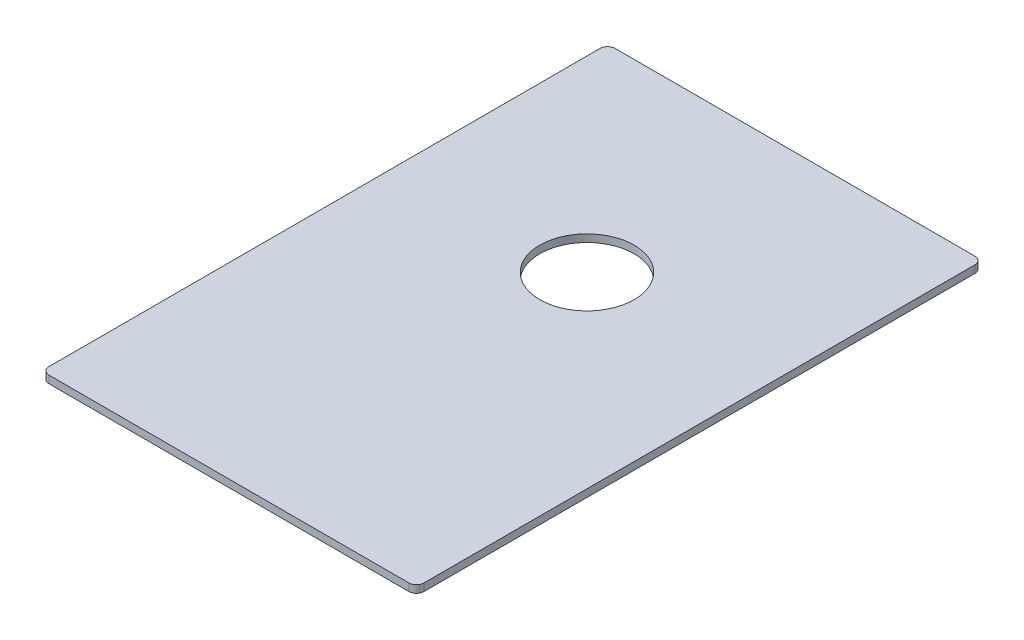
ISO-10303-21;
HEADER;
FILE_DESCRIPTION(('STEP AP214'),'2;1');
FILE_NAME('part.step','',(''),(''),'','','');
FILE_SCHEMA(('AUTOMOTIVE_DESIGN { 1 0 10303 214 1 1 1 1 }'));
ENDSEC;
DATA;
#1=APPLICATION_CONTEXT('core data for automotive mechanical design processes');
#2=APPLICATION_PROTOCOL_DEFINITION('international standard','automotive_design',2000,#1);
#3=PRODUCT_CONTEXT('',#1,'mechanical');
#4=PRODUCT('Part','Part','',(#3));
#5=PRODUCT_RELATED_PRODUCT_CATEGORY('part','',(#4));
#6=PRODUCT_DEFINITION_FORMATION('','',#4);
#7=PRODUCT_DEFINITION_CONTEXT('part definition',#1,'design');
#8=PRODUCT_DEFINITION('design','',#6,#7);
#9=PRODUCT_DEFINITION_SHAPE('','',#8);
#10=(LENGTH_UNIT() NAMED_UNIT(*) SI_UNIT(.MILLI.,.METRE.));
#11=(NAMED_UNIT(*) PLANE_ANGLE_UNIT() SI_UNIT($,.RADIAN.));
#12=(NAMED_UNIT(*) SI_UNIT($,.STERADIAN.) SOLID_ANGLE_UNIT());
#13=UNCERTAINTY_MEASURE_WITH_UNIT(LENGTH_MEASURE(1.E-05),#10,'distance_accuracy_value','');
#14=(GEOMETRIC_REPRESENTATION_CONTEXT(3) GLOBAL_UNCERTAINTY_ASSIGNED_CONTEXT((#13)) GLOBAL_UNIT_ASSIGNED_CONTEXT((#10,
#11,#12)) REPRESENTATION_CONTEXT('',''));
#15=CARTESIAN_POINT('',(0.,0.,0.));
#16=DIRECTION('',(0.,0.,1.));
#17=DIRECTION('',(1.,0.,0.));
#18=AXIS2_PLACEMENT_3D('',#15,#16,#17);
#19=CARTESIAN_POINT('',(-250.,10.,377.5));
#20=DIRECTION('',(0.,0.,-1.));
#21=DIRECTION('',(-1.,0.,0.));
#22=AXIS2_PLACEMENT_3D('',#19,#20,#21);
#23=PLANE('',#22);
#24=DIRECTION('',(1.,0.,0.));
#25=VECTOR('',#24,1.);
#26=CARTESIAN_POINT('',(-250.,10.,377.5));
#27=LINE('',#26,#25);
#28=CARTESIAN_POINT('',(-240.,10.,377.5));
#29=VERTEX_POINT('',#28);
#30=CARTESIAN_POINT('',(240.,10.,377.5));
#31=VERTEX_POINT('',#30);
#32=EDGE_CURVE('E118',#29,#31,#27,.T.);
#33=ORIENTED_EDGE('',*,*,#32,.F.);
#34=DIRECTION('',(0.,-1.,0.));
#35=VECTOR('',#34,1.);
#36=CARTESIAN_POINT('',(-240.,0.,377.5));
#37=LINE('',#36,#35);
#38=CARTESIAN_POINT('',(-240.,0.,377.5));
#39=VERTEX_POINT('',#38);
#40=EDGE_CURVE('E103',#29,#39,#37,.T.);
#41=ORIENTED_EDGE('',*,*,#40,.T.);
#42=DIRECTION('',(1.,0.,0.));
#43=VECTOR('',#42,1.);
#44=CARTESIAN_POINT('',(-250.,0.,377.5));
#45=LINE('',#44,#43);
#46=CARTESIAN_POINT('',(240.,0.,377.5));
#47=VERTEX_POINT('',#46);
#48=EDGE_CURVE('E115',#39,#47,#45,.T.);
#49=ORIENTED_EDGE('',*,*,#48,.T.);
#50=DIRECTION('',(0.,-1.,0.));
#51=VECTOR('',#50,1.);
#52=CARTESIAN_POINT('',(240.,10.,377.5));
#53=LINE('',#52,#51);
#54=EDGE_CURVE('E120',#47,#31,#53,.F.);
#55=ORIENTED_EDGE('',*,*,#54,.T.);
#56=EDGE_LOOP('',(#33,#41,#49,#55));
#57=FACE_BOUND('',#56,.T.);
#58=ADVANCED_FACE('F33',(#57),#23,.F.);
#59=CARTESIAN_POINT('',(250.,10.,377.5));
#60=DIRECTION('',(-1.,0.,0.));
#61=DIRECTION('',(0.,0.,1.));
#62=AXIS2_PLACEMENT_3D('',#59,#60,#61);
#63=PLANE('',#62);
#64=DIRECTION('',(0.,0.,-1.));
#65=VECTOR('',#64,1.);
#66=CARTESIAN_POINT('',(250.,10.,377.5));
#67=LINE('',#66,#65);
#68=CARTESIAN_POINT('',(250.,10.,367.5));
#69=VERTEX_POINT('',#68);
#70=CARTESIAN_POINT('',(250.,10.,-367.5));
#71=VERTEX_POINT('',#70);
#72=EDGE_CURVE('E165',#69,#71,#67,.T.);
#73=ORIENTED_EDGE('',*,*,#72,.F.);
#74=DIRECTION('',(0.,-1.,0.));
#75=VECTOR('',#74,1.);
#76=CARTESIAN_POINT('',(250.,10.,367.5));
#77=LINE('',#76,#75);
#78=CARTESIAN_POINT('',(250.,0.,367.5));
#79=VERTEX_POINT('',#78);
#80=EDGE_CURVE('E158',#69,#79,#77,.T.);
#81=ORIENTED_EDGE('',*,*,#80,.T.);
#82=DIRECTION('',(0.,0.,-1.));
#83=VECTOR('',#82,1.);
#84=CARTESIAN_POINT('',(250.,0.,377.5));
#85=LINE('',#84,#83);
#86=CARTESIAN_POINT('',(250.,0.,-367.5));
#87=VERTEX_POINT('',#86);
#88=EDGE_CURVE('E124',#79,#87,#85,.T.);
#89=ORIENTED_EDGE('',*,*,#88,.T.);
#90=DIRECTION('',(0.,-1.,0.));
#91=VECTOR('',#90,1.);
#92=CARTESIAN_POINT('',(250.,10.,-367.5));
#93=LINE('',#92,#91);
#94=EDGE_CURVE('E156',#87,#71,#93,.F.);
#95=ORIENTED_EDGE('',*,*,#94,.T.);
#96=EDGE_LOOP('',(#73,#81,#89,#95));
#97=FACE_BOUND('',#96,.T.);
#98=ADVANCED_FACE('F163',(#97),#63,.F.);
#99=CARTESIAN_POINT('',(-250.,10.,-377.5));
#100=DIRECTION('',(0.,0.,-1.));
#101=DIRECTION('',(-1.,0.,0.));
#102=AXIS2_PLACEMENT_3D('',#99,#100,#101);
#103=PLANE('',#102);
#104=DIRECTION('',(1.,0.,0.));
#105=VECTOR('',#104,1.);
#106=CARTESIAN_POINT('',(-250.,10.,-377.5));
#107=LINE('',#106,#105);
#108=CARTESIAN_POINT('',(-240.,10.,-377.5));
#109=VERTEX_POINT('',#108);
#110=CARTESIAN_POINT('',(240.,10.,-377.5));
#111=VERTEX_POINT('',#110);
#112=EDGE_CURVE('E172',#109,#111,#107,.T.);
#113=ORIENTED_EDGE('',*,*,#112,.T.);
#114=DIRECTION('',(0.,-1.,0.));
#115=VECTOR('',#114,1.);
#116=CARTESIAN_POINT('',(240.,0.,-377.5));
#117=LINE('',#116,#115);
#118=CARTESIAN_POINT('',(240.,0.,-377.5));
#119=VERTEX_POINT('',#118);
#120=EDGE_CURVE('E11',#111,#119,#117,.T.);
#121=ORIENTED_EDGE('',*,*,#120,.T.);
#122=DIRECTION('',(1.,0.,0.));
#123=VECTOR('',#122,1.);
#124=CARTESIAN_POINT('',(-250.,0.,-377.5));
#125=LINE('',#124,#123);
#126=CARTESIAN_POINT('',(-240.,0.,-377.5));
#127=VERTEX_POINT('',#126);
#128=EDGE_CURVE('E128',#127,#119,#125,.T.);
#129=ORIENTED_EDGE('',*,*,#128,.F.);
#130=DIRECTION('',(0.,-1.,0.));
#131=VECTOR('',#130,1.);
#132=CARTESIAN_POINT('',(-240.,10.,-377.5));
#133=LINE('',#132,#131);
#134=EDGE_CURVE('E41',#127,#109,#133,.F.);
#135=ORIENTED_EDGE('',*,*,#134,.T.);
#136=EDGE_LOOP('',(#113,#121,#129,#135));
#137=FACE_BOUND('',#136,.T.);
#138=ADVANCED_FACE('F171',(#137),#103,.T.);
#139=CARTESIAN_POINT('',(-250.,10.,377.5));
#140=DIRECTION('',(-1.,0.,0.));
#141=DIRECTION('',(0.,0.,1.));
#142=AXIS2_PLACEMENT_3D('',#139,#140,#141);
#143=PLANE('',#142);
#144=DIRECTION('',(0.,0.,-1.));
#145=VECTOR('',#144,1.);
#146=CARTESIAN_POINT('',(-250.,0.,377.5));
#147=LINE('',#146,#145);
#148=CARTESIAN_POINT('',(-250.,0.,367.5));
#149=VERTEX_POINT('',#148);
#150=CARTESIAN_POINT('',(-250.,0.,-367.5));
#151=VERTEX_POINT('',#150);
#152=EDGE_CURVE('E139',#149,#151,#147,.T.);
#153=ORIENTED_EDGE('',*,*,#152,.F.);
#154=DIRECTION('',(0.,-1.,0.));
#155=VECTOR('',#154,1.);
#156=CARTESIAN_POINT('',(-250.,10.,367.5));
#157=LINE('',#156,#155);
#158=CARTESIAN_POINT('',(-250.,10.,367.5));
#159=VERTEX_POINT('',#158);
#160=EDGE_CURVE('E104',#149,#159,#157,.F.);
#161=ORIENTED_EDGE('',*,*,#160,.T.);
#162=DIRECTION('',(0.,0.,-1.));
#163=VECTOR('',#162,1.);
#164=CARTESIAN_POINT('',(-250.,10.,377.5));
#165=LINE('',#164,#163);
#166=CARTESIAN_POINT('',(-250.,10.,-367.5));
#167=VERTEX_POINT('',#166);
#168=EDGE_CURVE('E134',#159,#167,#165,.T.);
#169=ORIENTED_EDGE('',*,*,#168,.T.);
#170=DIRECTION('',(0.,-1.,0.));
#171=VECTOR('',#170,1.);
#172=CARTESIAN_POINT('',(-250.,10.,-367.5));
#173=LINE('',#172,#171);
#174=EDGE_CURVE('E109',#167,#151,#173,.T.);
#175=ORIENTED_EDGE('',*,*,#174,.T.);
#176=EDGE_LOOP('',(#153,#161,#169,#175));
#177=FACE_BOUND('',#176,.T.);
#178=ADVANCED_FACE('F214',(#177),#143,.T.);
#179=CARTESIAN_POINT('',(0.,10.,0.));
#180=DIRECTION('',(0.,1.,0.));
#181=DIRECTION('',(0.,0.,1.));
#182=AXIS2_PLACEMENT_3D('',#179,#180,#181);
#183=PLANE('',#182);
#184=CARTESIAN_POINT('',(0.,10.,-100.));
#185=DIRECTION('',(0.,1.,0.));
#186=DIRECTION('',(0.,0.,1.));
#187=AXIS2_PLACEMENT_3D('',#184,#185,#186);
#188=CIRCLE('',#187,63.);
#189=CARTESIAN_POINT('',(0.,10.,-37.));
#190=VERTEX_POINT('',#189);
#191=EDGE_CURVE('E125',#190,#190,#188,.T.);
#192=ORIENTED_EDGE('',*,*,#191,.F.);
#193=EDGE_LOOP('',(#192));
#194=FACE_BOUND('',#193,.T.);
#195=ORIENTED_EDGE('',*,*,#168,.F.);
#196=CARTESIAN_POINT('',(-240.,10.,367.5));
#197=DIRECTION('',(0.,1.,0.));
#198=DIRECTION('',(0.,0.,1.));
#199=AXIS2_PLACEMENT_3D('',#196,#197,#198);
#200=CIRCLE('',#199,10.);
#201=EDGE_CURVE('E154',#159,#29,#200,.T.);
#202=ORIENTED_EDGE('',*,*,#201,.T.);
#203=ORIENTED_EDGE('',*,*,#32,.T.);
#204=CARTESIAN_POINT('',(240.,10.,367.5));
#205=DIRECTION('',(0.,1.,0.));
#206=DIRECTION('',(0.,0.,1.));
#207=AXIS2_PLACEMENT_3D('',#204,#205,#206);
#208=CIRCLE('',#207,10.);
#209=EDGE_CURVE('E152',#31,#69,#208,.T.);
#210=ORIENTED_EDGE('',*,*,#209,.T.);
#211=ORIENTED_EDGE('',*,*,#72,.T.);
#212=CARTESIAN_POINT('',(240.,10.,-367.5));
#213=DIRECTION('',(0.,1.,0.));
#214=DIRECTION('',(0.,0.,1.));
#215=AXIS2_PLACEMENT_3D('',#212,#213,#214);
#216=CIRCLE('',#215,10.);
#217=EDGE_CURVE('E48',#71,#111,#216,.T.);
#218=ORIENTED_EDGE('',*,*,#217,.T.);
#219=ORIENTED_EDGE('',*,*,#112,.F.);
#220=CARTESIAN_POINT('',(-240.,10.,-367.5));
#221=DIRECTION('',(0.,1.,0.));
#222=DIRECTION('',(0.,0.,1.));
#223=AXIS2_PLACEMENT_3D('',#220,#221,#222);
#224=CIRCLE('',#223,10.);
#225=EDGE_CURVE('E149',#109,#167,#224,.T.);
#226=ORIENTED_EDGE('',*,*,#225,.T.);
#227=EDGE_LOOP('',(#195,#202,#203,#210,#211,#218,#219,#226));
#228=FACE_BOUND('',#227,.T.);
#229=ADVANCED_FACE('F192',(#194,#228),#183,.T.);
#230=CARTESIAN_POINT('',(0.,0.,0.));
#231=DIRECTION('',(0.,1.,0.));
#232=DIRECTION('',(0.,0.,1.));
#233=AXIS2_PLACEMENT_3D('',#230,#231,#232);
#234=PLANE('',#233);
#235=CARTESIAN_POINT('',(0.,0.,-100.));
#236=DIRECTION('',(0.,1.,0.));
#237=DIRECTION('',(0.,0.,1.));
#238=AXIS2_PLACEMENT_3D('',#235,#236,#237);
#239=CIRCLE('',#238,63.);
#240=CARTESIAN_POINT('',(0.,0.,-37.));
#241=VERTEX_POINT('',#240);
#242=EDGE_CURVE('E131',#241,#241,#239,.T.);
#243=ORIENTED_EDGE('',*,*,#242,.T.);
#244=EDGE_LOOP('',(#243));
#245=FACE_BOUND('',#244,.T.);
#246=ORIENTED_EDGE('',*,*,#48,.F.);
#247=CARTESIAN_POINT('',(-240.,0.,367.5));
#248=DIRECTION('',(0.,1.,0.));
#249=DIRECTION('',(0.,0.,1.));
#250=AXIS2_PLACEMENT_3D('',#247,#248,#249);
#251=CIRCLE('',#250,10.);
#252=EDGE_CURVE('E99',#39,#149,#251,.F.);
#253=ORIENTED_EDGE('',*,*,#252,.T.);
#254=ORIENTED_EDGE('',*,*,#152,.T.);
#255=CARTESIAN_POINT('',(-240.,0.,-367.5));
#256=DIRECTION('',(0.,1.,0.));
#257=DIRECTION('',(0.,0.,1.));
#258=AXIS2_PLACEMENT_3D('',#255,#256,#257);
#259=CIRCLE('',#258,10.);
#260=EDGE_CURVE('E119',#151,#127,#259,.F.);
#261=ORIENTED_EDGE('',*,*,#260,.T.);
#262=ORIENTED_EDGE('',*,*,#128,.T.);
#263=CARTESIAN_POINT('',(240.,0.,-367.5));
#264=DIRECTION('',(0.,1.,0.));
#265=DIRECTION('',(0.,0.,1.));
#266=AXIS2_PLACEMENT_3D('',#263,#264,#265);
#267=CIRCLE('',#266,10.);
#268=EDGE_CURVE('E143',#119,#87,#267,.F.);
#269=ORIENTED_EDGE('',*,*,#268,.T.);
#270=ORIENTED_EDGE('',*,*,#88,.F.);
#271=CARTESIAN_POINT('',(240.,0.,367.5));
#272=DIRECTION('',(0.,1.,0.));
#273=DIRECTION('',(0.,0.,1.));
#274=AXIS2_PLACEMENT_3D('',#271,#272,#273);
#275=CIRCLE('',#274,10.);
#276=EDGE_CURVE('E110',#79,#47,#275,.F.);
#277=ORIENTED_EDGE('',*,*,#276,.T.);
#278=EDGE_LOOP('',(#246,#253,#254,#261,#262,#269,#270,#277));
#279=FACE_BOUND('',#278,.T.);
#280=ADVANCED_FACE('F122',(#245,#279),#234,.F.);
#281=CARTESIAN_POINT('',(0.,10.,-100.));
#282=DIRECTION('',(0.,-1.,0.));
#283=DIRECTION('',(0.,0.,-1.));
#284=AXIS2_PLACEMENT_3D('',#281,#282,#283);
#285=CYLINDRICAL_SURFACE('',#284,63.);
#286=ORIENTED_EDGE('',*,*,#191,.T.);
#287=EDGE_LOOP('',(#286));
#288=FACE_BOUND('',#287,.T.);
#289=ORIENTED_EDGE('',*,*,#242,.F.);
#290=EDGE_LOOP('',(#289));
#291=FACE_BOUND('',#290,.T.);
#292=ADVANCED_FACE('F182',(#288,#291),#285,.F.);
#293=CARTESIAN_POINT('',(-240.,10.,367.5));
#294=DIRECTION('',(0.,1.,0.));
#295=DIRECTION('',(0.,0.,1.));
#296=AXIS2_PLACEMENT_3D('',#293,#294,#295);
#297=CYLINDRICAL_SURFACE('',#296,10.);
#298=ORIENTED_EDGE('',*,*,#201,.F.);
#299=ORIENTED_EDGE('',*,*,#160,.F.);
#300=ORIENTED_EDGE('',*,*,#252,.F.);
#301=ORIENTED_EDGE('',*,*,#40,.F.);
#302=EDGE_LOOP('',(#298,#299,#300,#301));
#303=FACE_BOUND('',#302,.T.);
#304=ADVANCED_FACE('F102',(#303),#297,.T.);
#305=CARTESIAN_POINT('',(240.,10.,367.5));
#306=DIRECTION('',(0.,-1.,0.));
#307=DIRECTION('',(0.,0.,-1.));
#308=AXIS2_PLACEMENT_3D('',#305,#306,#307);
#309=CYLINDRICAL_SURFACE('',#308,10.);
#310=ORIENTED_EDGE('',*,*,#209,.F.);
#311=ORIENTED_EDGE('',*,*,#54,.F.);
#312=ORIENTED_EDGE('',*,*,#276,.F.);
#313=ORIENTED_EDGE('',*,*,#80,.F.);
#314=EDGE_LOOP('',(#310,#311,#312,#313));
#315=FACE_BOUND('',#314,.T.);
#316=ADVANCED_FACE('F190',(#315),#309,.T.);
#317=CARTESIAN_POINT('',(240.,10.,-367.5));
#318=DIRECTION('',(0.,1.,0.));
#319=DIRECTION('',(0.,0.,1.));
#320=AXIS2_PLACEMENT_3D('',#317,#318,#319);
#321=CYLINDRICAL_SURFACE('',#320,10.);
#322=ORIENTED_EDGE('',*,*,#217,.F.);
#323=ORIENTED_EDGE('',*,*,#94,.F.);
#324=ORIENTED_EDGE('',*,*,#268,.F.);
#325=ORIENTED_EDGE('',*,*,#120,.F.);
#326=EDGE_LOOP('',(#322,#323,#324,#325));
#327=FACE_BOUND('',#326,.T.);
#328=ADVANCED_FACE('F170',(#327),#321,.T.);
#329=CARTESIAN_POINT('',(-240.,10.,-367.5));
#330=DIRECTION('',(0.,-1.,0.));
#331=DIRECTION('',(0.,0.,-1.));
#332=AXIS2_PLACEMENT_3D('',#329,#330,#331);
#333=CYLINDRICAL_SURFACE('',#332,10.);
#334=ORIENTED_EDGE('',*,*,#225,.F.);
#335=ORIENTED_EDGE('',*,*,#134,.F.);
#336=ORIENTED_EDGE('',*,*,#260,.F.);
#337=ORIENTED_EDGE('',*,*,#174,.F.);
#338=EDGE_LOOP('',(#334,#335,#336,#337));
#339=FACE_BOUND('',#338,.T.);
#340=ADVANCED_FACE('F35',(#339),#333,.T.);
#341=CLOSED_SHELL('',(#58,#98,#138,#178,#229,#280,#292,#304,#316,#328,#340));
#342=MANIFOLD_SOLID_BREP('B2',#341);
#343=ADVANCED_BREP_SHAPE_REPRESENTATION('',(#18,#342),#14);
#344=SHAPE_DEFINITION_REPRESENTATION(#9,#343);
ENDSEC;
END-ISO-10303-21;
